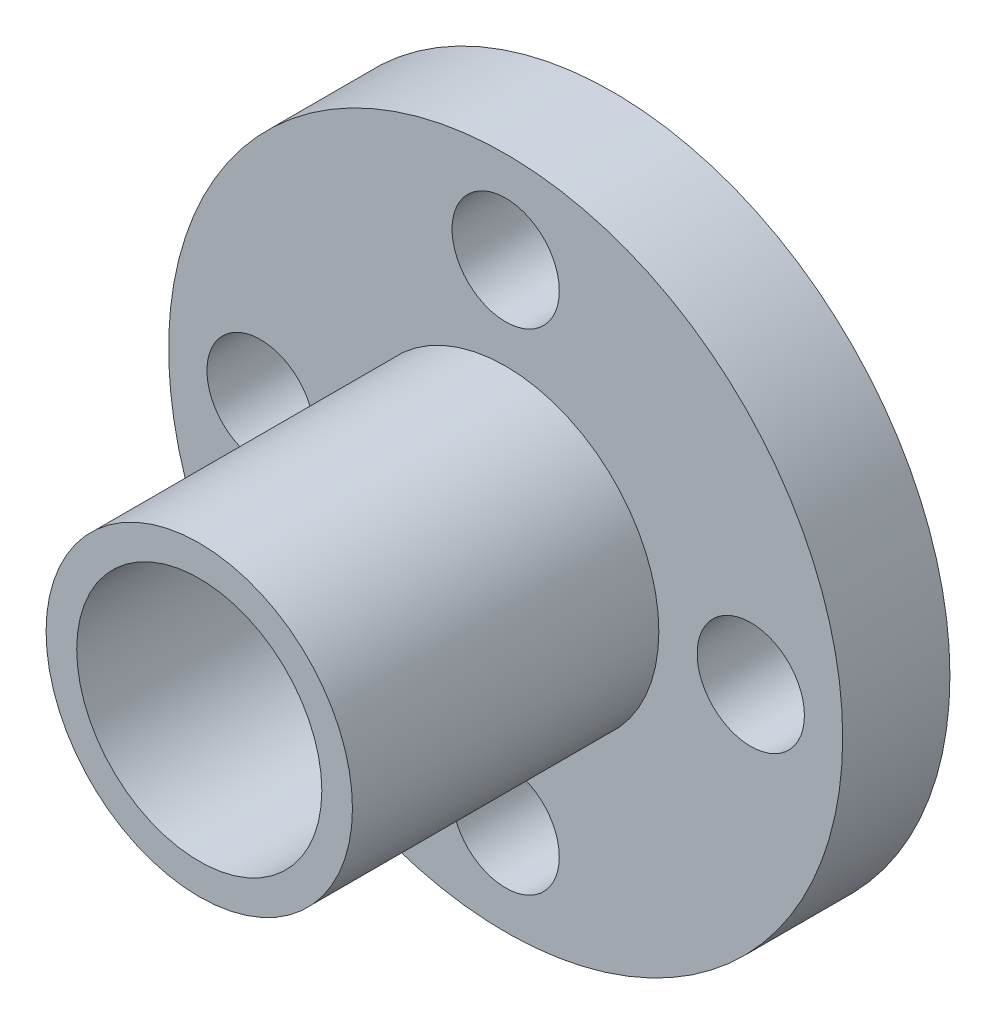
ISO-10303-21;
HEADER;
FILE_DESCRIPTION(('STEP AP214'),'2;1');
FILE_NAME('part.step','',(''),(''),'','','');
FILE_SCHEMA(('AUTOMOTIVE_DESIGN { 1 0 10303 214 1 1 1 1 }'));
ENDSEC;
DATA;
#1=APPLICATION_CONTEXT('core data for automotive mechanical design processes');
#2=APPLICATION_PROTOCOL_DEFINITION('international standard','automotive_design',2000,#1);
#3=PRODUCT_CONTEXT('',#1,'mechanical');
#4=PRODUCT('Part','Part','',(#3));
#5=PRODUCT_RELATED_PRODUCT_CATEGORY('part','',(#4));
#6=PRODUCT_DEFINITION_FORMATION('','',#4);
#7=PRODUCT_DEFINITION_CONTEXT('part definition',#1,'design');
#8=PRODUCT_DEFINITION('design','',#6,#7);
#9=PRODUCT_DEFINITION_SHAPE('','',#8);
#10=(LENGTH_UNIT() NAMED_UNIT(*) SI_UNIT(.MILLI.,.METRE.));
#11=(NAMED_UNIT(*) PLANE_ANGLE_UNIT() SI_UNIT($,.RADIAN.));
#12=(NAMED_UNIT(*) SI_UNIT($,.STERADIAN.) SOLID_ANGLE_UNIT());
#13=UNCERTAINTY_MEASURE_WITH_UNIT(LENGTH_MEASURE(1.E-05),#10,'distance_accuracy_value','');
#14=(GEOMETRIC_REPRESENTATION_CONTEXT(3) GLOBAL_UNCERTAINTY_ASSIGNED_CONTEXT((#13)) GLOBAL_UNIT_ASSIGNED_CONTEXT((#10,
#11,#12)) REPRESENTATION_CONTEXT('',''));
#15=CARTESIAN_POINT('',(0.,0.,0.));
#16=DIRECTION('',(0.,0.,1.));
#17=DIRECTION('',(1.,0.,0.));
#18=AXIS2_PLACEMENT_3D('',#15,#16,#17);
#19=CARTESIAN_POINT('',(0.,0.,1.5));
#20=DIRECTION('',(0.,0.,-1.));
#21=DIRECTION('',(-1.,0.,0.));
#22=AXIS2_PLACEMENT_3D('',#19,#20,#21);
#23=CYLINDRICAL_SURFACE('',#22,5.);
#24=CARTESIAN_POINT('',(0.,0.,1.5));
#25=DIRECTION('',(0.,0.,1.));
#26=DIRECTION('',(1.,0.,0.));
#27=AXIS2_PLACEMENT_3D('',#24,#25,#26);
#28=CIRCLE('',#27,5.);
#29=CARTESIAN_POINT('',(5.,0.,1.5));
#30=VERTEX_POINT('',#29);
#31=EDGE_CURVE('E10',#30,#30,#28,.T.);
#32=ORIENTED_EDGE('',*,*,#31,.F.);
#33=EDGE_LOOP('',(#32));
#34=FACE_BOUND('',#33,.T.);
#35=CARTESIAN_POINT('',(0.,0.,0.));
#36=DIRECTION('',(0.,0.,1.));
#37=DIRECTION('',(1.,0.,0.));
#38=AXIS2_PLACEMENT_3D('',#35,#36,#37);
#39=CIRCLE('',#38,5.);
#40=CARTESIAN_POINT('',(5.,0.,0.));
#41=VERTEX_POINT('',#40);
#42=EDGE_CURVE('E39',#41,#41,#39,.T.);
#43=ORIENTED_EDGE('',*,*,#42,.T.);
#44=EDGE_LOOP('',(#43));
#45=FACE_BOUND('',#44,.T.);
#46=ADVANCED_FACE('F32',(#34,#45),#23,.T.);
#47=CARTESIAN_POINT('',(0.,0.,0.));
#48=DIRECTION('',(0.,0.,1.));
#49=DIRECTION('',(1.,0.,0.));
#50=AXIS2_PLACEMENT_3D('',#47,#48,#49);
#51=PLANE('',#50);
#52=CARTESIAN_POINT('',(0.,0.,0.));
#53=DIRECTION('',(0.,0.,1.));
#54=DIRECTION('',(1.,0.,0.));
#55=AXIS2_PLACEMENT_3D('',#52,#53,#54);
#56=CIRCLE('',#55,4.);
#57=CARTESIAN_POINT('',(4.,0.,0.));
#58=VERTEX_POINT('',#57);
#59=EDGE_CURVE('E120',#58,#58,#56,.T.);
#60=ORIENTED_EDGE('',*,*,#59,.T.);
#61=EDGE_LOOP('',(#60));
#62=FACE_BOUND('',#61,.T.);
#63=ORIENTED_EDGE('',*,*,#42,.F.);
#64=EDGE_LOOP('',(#63));
#65=FACE_BOUND('',#64,.T.);
#66=ADVANCED_FACE('F105',(#62,#65),#51,.F.);
#67=CARTESIAN_POINT('',(0.,0.,5.));
#68=DIRECTION('',(0.,0.,-1.));
#69=DIRECTION('',(-1.,0.,0.));
#70=AXIS2_PLACEMENT_3D('',#67,#68,#69);
#71=CYLINDRICAL_SURFACE('',#70,11.);
#72=CARTESIAN_POINT('',(0.,0.,5.));
#73=DIRECTION('',(0.,0.,1.));
#74=DIRECTION('',(1.,0.,0.));
#75=AXIS2_PLACEMENT_3D('',#72,#73,#74);
#76=CIRCLE('',#75,11.);
#77=CARTESIAN_POINT('',(11.,0.,5.));
#78=VERTEX_POINT('',#77);
#79=EDGE_CURVE('E44',#78,#78,#76,.T.);
#80=ORIENTED_EDGE('',*,*,#79,.F.);
#81=EDGE_LOOP('',(#80));
#82=FACE_BOUND('',#81,.T.);
#83=CARTESIAN_POINT('',(0.,0.,1.5));
#84=DIRECTION('',(0.,0.,1.));
#85=DIRECTION('',(1.,0.,0.));
#86=AXIS2_PLACEMENT_3D('',#83,#84,#85);
#87=CIRCLE('',#86,11.);
#88=CARTESIAN_POINT('',(11.,0.,1.5));
#89=VERTEX_POINT('',#88);
#90=EDGE_CURVE('E47',#89,#89,#87,.T.);
#91=ORIENTED_EDGE('',*,*,#90,.T.);
#92=EDGE_LOOP('',(#91));
#93=FACE_BOUND('',#92,.T.);
#94=ADVANCED_FACE('F86',(#82,#93),#71,.T.);
#95=CARTESIAN_POINT('',(0.,0.,5.));
#96=DIRECTION('',(0.,0.,1.));
#97=DIRECTION('',(1.,0.,0.));
#98=AXIS2_PLACEMENT_3D('',#95,#96,#97);
#99=PLANE('',#98);
#100=CARTESIAN_POINT('',(-8.,0.,5.));
#101=DIRECTION('',(0.,0.,1.));
#102=DIRECTION('',(1.,0.,0.));
#103=AXIS2_PLACEMENT_3D('',#100,#101,#102);
#104=CIRCLE('',#103,1.75);
#105=CARTESIAN_POINT('',(-6.25,0.,5.));
#106=VERTEX_POINT('',#105);
#107=EDGE_CURVE('E70',#106,#106,#104,.T.);
#108=ORIENTED_EDGE('',*,*,#107,.F.);
#109=EDGE_LOOP('',(#108));
#110=FACE_BOUND('',#109,.T.);
#111=CARTESIAN_POINT('',(8.,0.,5.));
#112=DIRECTION('',(0.,0.,1.));
#113=DIRECTION('',(1.,0.,0.));
#114=AXIS2_PLACEMENT_3D('',#111,#112,#113);
#115=CIRCLE('',#114,1.75);
#116=CARTESIAN_POINT('',(9.75,0.,5.));
#117=VERTEX_POINT('',#116);
#118=EDGE_CURVE('E60',#117,#117,#115,.T.);
#119=ORIENTED_EDGE('',*,*,#118,.F.);
#120=EDGE_LOOP('',(#119));
#121=FACE_BOUND('',#120,.T.);
#122=CARTESIAN_POINT('',(0.,-8.,5.));
#123=DIRECTION('',(0.,0.,1.));
#124=DIRECTION('',(1.,0.,0.));
#125=AXIS2_PLACEMENT_3D('',#122,#123,#124);
#126=CIRCLE('',#125,1.75);
#127=CARTESIAN_POINT('',(1.75,-8.,5.));
#128=VERTEX_POINT('',#127);
#129=EDGE_CURVE('E57',#128,#128,#126,.T.);
#130=ORIENTED_EDGE('',*,*,#129,.F.);
#131=EDGE_LOOP('',(#130));
#132=FACE_BOUND('',#131,.T.);
#133=CARTESIAN_POINT('',(0.,8.,5.));
#134=DIRECTION('',(0.,0.,1.));
#135=DIRECTION('',(1.,0.,0.));
#136=AXIS2_PLACEMENT_3D('',#133,#134,#135);
#137=CIRCLE('',#136,1.75);
#138=CARTESIAN_POINT('',(1.75,8.,5.));
#139=VERTEX_POINT('',#138);
#140=EDGE_CURVE('E54',#139,#139,#137,.T.);
#141=ORIENTED_EDGE('',*,*,#140,.F.);
#142=EDGE_LOOP('',(#141));
#143=FACE_BOUND('',#142,.T.);
#144=CARTESIAN_POINT('',(0.,0.,5.));
#145=DIRECTION('',(0.,0.,1.));
#146=DIRECTION('',(1.,0.,0.));
#147=AXIS2_PLACEMENT_3D('',#144,#145,#146);
#148=CIRCLE('',#147,5.);
#149=CARTESIAN_POINT('',(5.,0.,5.));
#150=VERTEX_POINT('',#149);
#151=EDGE_CURVE('E53',#150,#150,#148,.T.);
#152=ORIENTED_EDGE('',*,*,#151,.F.);
#153=EDGE_LOOP('',(#152));
#154=FACE_BOUND('',#153,.T.);
#155=ORIENTED_EDGE('',*,*,#79,.T.);
#156=EDGE_LOOP('',(#155));
#157=FACE_BOUND('',#156,.T.);
#158=ADVANCED_FACE('F91',(#110,#121,#132,#143,#154,#157),#99,.T.);
#159=CARTESIAN_POINT('',(0.,0.,1.5));
#160=DIRECTION('',(0.,0.,1.));
#161=DIRECTION('',(1.,0.,0.));
#162=AXIS2_PLACEMENT_3D('',#159,#160,#161);
#163=PLANE('',#162);
#164=CARTESIAN_POINT('',(-8.,0.,1.5));
#165=DIRECTION('',(0.,0.,1.));
#166=DIRECTION('',(1.,0.,0.));
#167=AXIS2_PLACEMENT_3D('',#164,#165,#166);
#168=CIRCLE('',#167,1.75);
#169=CARTESIAN_POINT('',(-6.25,0.,1.5));
#170=VERTEX_POINT('',#169);
#171=EDGE_CURVE('E35',#170,#170,#168,.T.);
#172=ORIENTED_EDGE('',*,*,#171,.T.);
#173=EDGE_LOOP('',(#172));
#174=FACE_BOUND('',#173,.T.);
#175=CARTESIAN_POINT('',(8.,0.,1.5));
#176=DIRECTION('',(0.,0.,1.));
#177=DIRECTION('',(1.,0.,0.));
#178=AXIS2_PLACEMENT_3D('',#175,#176,#177);
#179=CIRCLE('',#178,1.75);
#180=CARTESIAN_POINT('',(9.75,0.,1.5));
#181=VERTEX_POINT('',#180);
#182=EDGE_CURVE('E58',#181,#181,#179,.T.);
#183=ORIENTED_EDGE('',*,*,#182,.T.);
#184=EDGE_LOOP('',(#183));
#185=FACE_BOUND('',#184,.T.);
#186=CARTESIAN_POINT('',(0.,-8.,1.5));
#187=DIRECTION('',(0.,0.,1.));
#188=DIRECTION('',(1.,0.,0.));
#189=AXIS2_PLACEMENT_3D('',#186,#187,#188);
#190=CIRCLE('',#189,1.75);
#191=CARTESIAN_POINT('',(1.75,-8.,1.5));
#192=VERTEX_POINT('',#191);
#193=EDGE_CURVE('E55',#192,#192,#190,.T.);
#194=ORIENTED_EDGE('',*,*,#193,.T.);
#195=EDGE_LOOP('',(#194));
#196=FACE_BOUND('',#195,.T.);
#197=CARTESIAN_POINT('',(0.,8.,1.5));
#198=DIRECTION('',(0.,0.,1.));
#199=DIRECTION('',(1.,0.,0.));
#200=AXIS2_PLACEMENT_3D('',#197,#198,#199);
#201=CIRCLE('',#200,1.75);
#202=CARTESIAN_POINT('',(1.75,8.,1.5));
#203=VERTEX_POINT('',#202);
#204=EDGE_CURVE('E50',#203,#203,#201,.T.);
#205=ORIENTED_EDGE('',*,*,#204,.T.);
#206=EDGE_LOOP('',(#205));
#207=FACE_BOUND('',#206,.T.);
#208=ORIENTED_EDGE('',*,*,#31,.T.);
#209=EDGE_LOOP('',(#208));
#210=FACE_BOUND('',#209,.T.);
#211=ORIENTED_EDGE('',*,*,#90,.F.);
#212=EDGE_LOOP('',(#211));
#213=FACE_BOUND('',#212,.T.);
#214=ADVANCED_FACE('F88',(#174,#185,#196,#207,#210,#213),#163,.F.);
#215=CARTESIAN_POINT('',(0.,0.,15.));
#216=DIRECTION('',(0.,0.,-1.));
#217=DIRECTION('',(-1.,0.,0.));
#218=AXIS2_PLACEMENT_3D('',#215,#216,#217);
#219=CYLINDRICAL_SURFACE('',#218,5.);
#220=CARTESIAN_POINT('',(0.,0.,15.));
#221=DIRECTION('',(0.,0.,1.));
#222=DIRECTION('',(1.,0.,0.));
#223=AXIS2_PLACEMENT_3D('',#220,#221,#222);
#224=CIRCLE('',#223,5.);
#225=CARTESIAN_POINT('',(5.,0.,15.));
#226=VERTEX_POINT('',#225);
#227=EDGE_CURVE('E76',#226,#226,#224,.T.);
#228=ORIENTED_EDGE('',*,*,#227,.F.);
#229=EDGE_LOOP('',(#228));
#230=FACE_BOUND('',#229,.T.);
#231=ORIENTED_EDGE('',*,*,#151,.T.);
#232=EDGE_LOOP('',(#231));
#233=FACE_BOUND('',#232,.T.);
#234=ADVANCED_FACE('F90',(#230,#233),#219,.T.);
#235=CARTESIAN_POINT('',(0.,0.,15.));
#236=DIRECTION('',(0.,0.,1.));
#237=DIRECTION('',(1.,0.,0.));
#238=AXIS2_PLACEMENT_3D('',#235,#236,#237);
#239=PLANE('',#238);
#240=CARTESIAN_POINT('',(0.,0.,15.));
#241=DIRECTION('',(0.,0.,1.));
#242=DIRECTION('',(1.,0.,0.));
#243=AXIS2_PLACEMENT_3D('',#240,#241,#242);
#244=CIRCLE('',#243,4.);
#245=CARTESIAN_POINT('',(4.,0.,15.));
#246=VERTEX_POINT('',#245);
#247=EDGE_CURVE('E122',#246,#246,#244,.T.);
#248=ORIENTED_EDGE('',*,*,#247,.F.);
#249=EDGE_LOOP('',(#248));
#250=FACE_BOUND('',#249,.T.);
#251=ORIENTED_EDGE('',*,*,#227,.T.);
#252=EDGE_LOOP('',(#251));
#253=FACE_BOUND('',#252,.T.);
#254=ADVANCED_FACE('F98',(#250,#253),#239,.T.);
#255=CARTESIAN_POINT('',(0.,8.,1.));
#256=DIRECTION('',(0.,0.,1.));
#257=DIRECTION('',(1.,0.,0.));
#258=AXIS2_PLACEMENT_3D('',#255,#256,#257);
#259=CYLINDRICAL_SURFACE('',#258,1.75);
#260=ORIENTED_EDGE('',*,*,#140,.T.);
#261=EDGE_LOOP('',(#260));
#262=FACE_BOUND('',#261,.T.);
#263=ORIENTED_EDGE('',*,*,#204,.F.);
#264=EDGE_LOOP('',(#263));
#265=FACE_BOUND('',#264,.T.);
#266=ADVANCED_FACE('F132',(#262,#265),#259,.F.);
#267=CARTESIAN_POINT('',(0.,-8.,1.));
#268=DIRECTION('',(0.,0.,1.));
#269=DIRECTION('',(1.,0.,0.));
#270=AXIS2_PLACEMENT_3D('',#267,#268,#269);
#271=CYLINDRICAL_SURFACE('',#270,1.75);
#272=ORIENTED_EDGE('',*,*,#129,.T.);
#273=EDGE_LOOP('',(#272));
#274=FACE_BOUND('',#273,.T.);
#275=ORIENTED_EDGE('',*,*,#193,.F.);
#276=EDGE_LOOP('',(#275));
#277=FACE_BOUND('',#276,.T.);
#278=ADVANCED_FACE('F141',(#274,#277),#271,.F.);
#279=CARTESIAN_POINT('',(8.,0.,1.));
#280=DIRECTION('',(0.,0.,1.));
#281=DIRECTION('',(1.,0.,0.));
#282=AXIS2_PLACEMENT_3D('',#279,#280,#281);
#283=CYLINDRICAL_SURFACE('',#282,1.75);
#284=ORIENTED_EDGE('',*,*,#118,.T.);
#285=EDGE_LOOP('',(#284));
#286=FACE_BOUND('',#285,.T.);
#287=ORIENTED_EDGE('',*,*,#182,.F.);
#288=EDGE_LOOP('',(#287));
#289=FACE_BOUND('',#288,.T.);
#290=ADVANCED_FACE('F147',(#286,#289),#283,.F.);
#291=CARTESIAN_POINT('',(-8.,0.,1.));
#292=DIRECTION('',(0.,0.,1.));
#293=DIRECTION('',(1.,0.,0.));
#294=AXIS2_PLACEMENT_3D('',#291,#292,#293);
#295=CYLINDRICAL_SURFACE('',#294,1.75);
#296=ORIENTED_EDGE('',*,*,#107,.T.);
#297=EDGE_LOOP('',(#296));
#298=FACE_BOUND('',#297,.T.);
#299=ORIENTED_EDGE('',*,*,#171,.F.);
#300=EDGE_LOOP('',(#299));
#301=FACE_BOUND('',#300,.T.);
#302=ADVANCED_FACE('F151',(#298,#301),#295,.F.);
#303=CARTESIAN_POINT('',(0.,0.,0.));
#304=DIRECTION('',(0.,0.,1.));
#305=DIRECTION('',(1.,0.,0.));
#306=AXIS2_PLACEMENT_3D('',#303,#304,#305);
#307=CYLINDRICAL_SURFACE('',#306,4.);
#308=ORIENTED_EDGE('',*,*,#59,.F.);
#309=EDGE_LOOP('',(#308));
#310=FACE_BOUND('',#309,.T.);
#311=ORIENTED_EDGE('',*,*,#247,.T.);
#312=EDGE_LOOP('',(#311));
#313=FACE_BOUND('',#312,.T.);
#314=ADVANCED_FACE('F128',(#310,#313),#307,.F.);
#315=CLOSED_SHELL('',(#46,#66,#94,#158,#214,#234,#254,#266,#278,#290,#302,#314));
#316=MANIFOLD_SOLID_BREP('B2',#315);
#317=ADVANCED_BREP_SHAPE_REPRESENTATION('',(#18,#316),#14);
#318=SHAPE_DEFINITION_REPRESENTATION(#9,#317);
ENDSEC;
END-ISO-10303-21;
